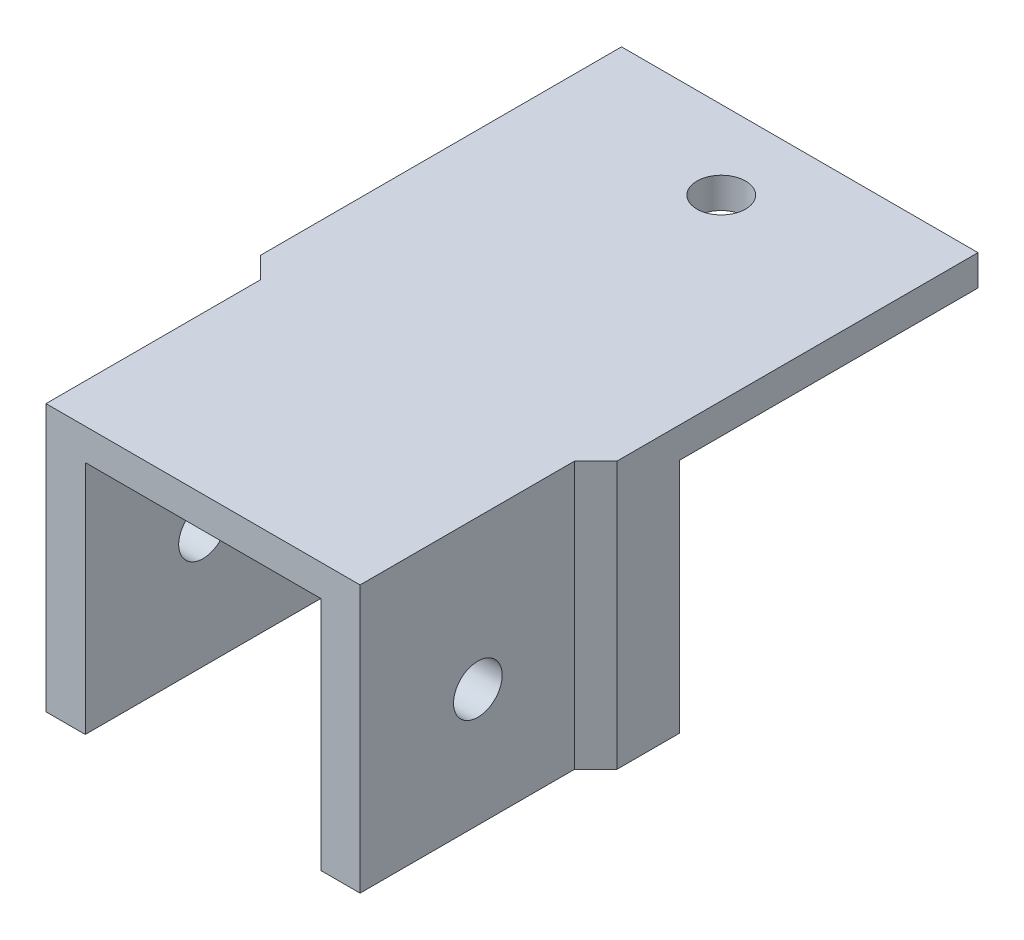
ISO-10303-21;
HEADER;
FILE_DESCRIPTION(('STEP AP214'),'2;1');
FILE_NAME('part.step','',(''),(''),'','','');
FILE_SCHEMA(('AUTOMOTIVE_DESIGN { 1 0 10303 214 1 1 1 1 }'));
ENDSEC;
DATA;
#1=APPLICATION_CONTEXT('core data for automotive mechanical design processes');
#2=APPLICATION_PROTOCOL_DEFINITION('international standard','automotive_design',2000,#1);
#3=PRODUCT_CONTEXT('',#1,'mechanical');
#4=PRODUCT('Part','Part','',(#3));
#5=PRODUCT_RELATED_PRODUCT_CATEGORY('part','',(#4));
#6=PRODUCT_DEFINITION_FORMATION('','',#4);
#7=PRODUCT_DEFINITION_CONTEXT('part definition',#1,'design');
#8=PRODUCT_DEFINITION('design','',#6,#7);
#9=PRODUCT_DEFINITION_SHAPE('','',#8);
#10=(LENGTH_UNIT() NAMED_UNIT(*) SI_UNIT(.MILLI.,.METRE.));
#11=(NAMED_UNIT(*) PLANE_ANGLE_UNIT() SI_UNIT($,.RADIAN.));
#12=(NAMED_UNIT(*) SI_UNIT($,.STERADIAN.) SOLID_ANGLE_UNIT());
#13=UNCERTAINTY_MEASURE_WITH_UNIT(LENGTH_MEASURE(1.E-05),#10,'distance_accuracy_value','');
#14=(GEOMETRIC_REPRESENTATION_CONTEXT(3) GLOBAL_UNCERTAINTY_ASSIGNED_CONTEXT((#13)) GLOBAL_UNIT_ASSIGNED_CONTEXT((#10,
#11,#12)) REPRESENTATION_CONTEXT('',''));
#15=CARTESIAN_POINT('',(0.,0.,0.));
#16=DIRECTION('',(0.,0.,1.));
#17=DIRECTION('',(1.,0.,0.));
#18=AXIS2_PLACEMENT_3D('',#15,#16,#17);
#19=CARTESIAN_POINT('',(22.7,15.,5.));
#20=DIRECTION('',(-1.,0.,0.));
#21=DIRECTION('',(0.,0.,1.));
#22=AXIS2_PLACEMENT_3D('',#19,#20,#21);
#23=PLANE('',#22);
#24=DIRECTION('',(0.,1.,0.));
#25=VECTOR('',#24,1.);
#26=CARTESIAN_POINT('',(22.7,-15.,8.));
#27=LINE('',#26,#25);
#28=CARTESIAN_POINT('',(22.7,-15.,8.));
#29=VERTEX_POINT('',#28);
#30=CARTESIAN_POINT('',(22.7,19.,8.));
#31=VERTEX_POINT('',#30);
#32=EDGE_CURVE('E166',#29,#31,#27,.T.);
#33=ORIENTED_EDGE('',*,*,#32,.F.);
#34=DIRECTION('',(0.,0.,-1.));
#35=VECTOR('',#34,1.);
#36=CARTESIAN_POINT('',(22.7,-15.,5.));
#37=LINE('',#36,#35);
#38=CARTESIAN_POINT('',(22.7,-15.,0.));
#39=VERTEX_POINT('',#38);
#40=EDGE_CURVE('E154',#29,#39,#37,.T.);
#41=ORIENTED_EDGE('',*,*,#40,.T.);
#42=DIRECTION('',(0.,1.,0.));
#43=VECTOR('',#42,1.);
#44=CARTESIAN_POINT('',(22.7,15.,0.));
#45=LINE('',#44,#43);
#46=CARTESIAN_POINT('',(22.7,15.1,0.));
#47=VERTEX_POINT('',#46);
#48=EDGE_CURVE('E289',#39,#47,#45,.T.);
#49=ORIENTED_EDGE('',*,*,#48,.T.);
#50=DIRECTION('',(0.,0.,-1.));
#51=VECTOR('',#50,1.);
#52=CARTESIAN_POINT('',(22.7,15.1,-38.));
#53=LINE('',#52,#51);
#54=CARTESIAN_POINT('',(22.7,15.1,-38.));
#55=VERTEX_POINT('',#54);
#56=EDGE_CURVE('E186',#47,#55,#53,.T.);
#57=ORIENTED_EDGE('',*,*,#56,.T.);
#58=DIRECTION('',(0.,1.,0.));
#59=VECTOR('',#58,1.);
#60=CARTESIAN_POINT('',(22.7,15.1,-38.));
#61=LINE('',#60,#59);
#62=CARTESIAN_POINT('',(22.7,19.,-38.));
#63=VERTEX_POINT('',#62);
#64=EDGE_CURVE('E194',#55,#63,#61,.T.);
#65=ORIENTED_EDGE('',*,*,#64,.T.);
#66=DIRECTION('',(0.,0.,-1.));
#67=VECTOR('',#66,1.);
#68=CARTESIAN_POINT('',(22.7,19.,5.));
#69=LINE('',#68,#67);
#70=EDGE_CURVE('E299',#31,#63,#69,.T.);
#71=ORIENTED_EDGE('',*,*,#70,.F.);
#72=EDGE_LOOP('',(#33,#41,#49,#57,#65,#71));
#73=FACE_BOUND('',#72,.T.);
#74=ADVANCED_FACE('F37',(#73),#23,.F.);
#75=CARTESIAN_POINT('',(-22.7,-15.,5.));
#76=DIRECTION('',(1.,0.,0.));
#77=DIRECTION('',(0.,0.,-1.));
#78=AXIS2_PLACEMENT_3D('',#75,#76,#77);
#79=PLANE('',#78);
#80=DIRECTION('',(0.,-1.,0.));
#81=VECTOR('',#80,1.);
#82=CARTESIAN_POINT('',(-22.7,19.,8.));
#83=LINE('',#82,#81);
#84=CARTESIAN_POINT('',(-22.7,19.,8.));
#85=VERTEX_POINT('',#84);
#86=CARTESIAN_POINT('',(-22.7,-15.,8.));
#87=VERTEX_POINT('',#86);
#88=EDGE_CURVE('E148',#85,#87,#83,.T.);
#89=ORIENTED_EDGE('',*,*,#88,.F.);
#90=DIRECTION('',(0.,0.,-1.));
#91=VECTOR('',#90,1.);
#92=CARTESIAN_POINT('',(-22.7,19.,5.));
#93=LINE('',#92,#91);
#94=CARTESIAN_POINT('',(-22.7,19.,-38.));
#95=VERTEX_POINT('',#94);
#96=EDGE_CURVE('E153',#85,#95,#93,.T.);
#97=ORIENTED_EDGE('',*,*,#96,.T.);
#98=DIRECTION('',(0.,1.,0.));
#99=VECTOR('',#98,1.);
#100=CARTESIAN_POINT('',(-22.7,15.1,-38.));
#101=LINE('',#100,#99);
#102=CARTESIAN_POINT('',(-22.7,15.1,-38.));
#103=VERTEX_POINT('',#102);
#104=EDGE_CURVE('E197',#103,#95,#101,.T.);
#105=ORIENTED_EDGE('',*,*,#104,.F.);
#106=DIRECTION('',(0.,0.,1.));
#107=VECTOR('',#106,1.);
#108=CARTESIAN_POINT('',(-22.7,15.1,0.));
#109=LINE('',#108,#107);
#110=CARTESIAN_POINT('',(-22.7,15.1,0.));
#111=VERTEX_POINT('',#110);
#112=EDGE_CURVE('E192',#103,#111,#109,.T.);
#113=ORIENTED_EDGE('',*,*,#112,.T.);
#114=DIRECTION('',(0.,-1.,0.));
#115=VECTOR('',#114,1.);
#116=CARTESIAN_POINT('',(-22.7,-15.,0.));
#117=LINE('',#116,#115);
#118=CARTESIAN_POINT('',(-22.7,-15.,0.));
#119=VERTEX_POINT('',#118);
#120=EDGE_CURVE('E151',#111,#119,#117,.T.);
#121=ORIENTED_EDGE('',*,*,#120,.T.);
#122=DIRECTION('',(0.,0.,-1.));
#123=VECTOR('',#122,1.);
#124=CARTESIAN_POINT('',(-22.7,-15.,5.));
#125=LINE('',#124,#123);
#126=EDGE_CURVE('E140',#87,#119,#125,.T.);
#127=ORIENTED_EDGE('',*,*,#126,.F.);
#128=EDGE_LOOP('',(#89,#97,#105,#113,#121,#127));
#129=FACE_BOUND('',#128,.T.);
#130=ADVANCED_FACE('F147',(#129),#79,.F.);
#131=CARTESIAN_POINT('',(0.,0.,8.));
#132=DIRECTION('',(0.,0.,1.));
#133=DIRECTION('',(1.,0.,0.));
#134=AXIS2_PLACEMENT_3D('',#131,#132,#133);
#135=PLANE('',#134);
#136=CARTESIAN_POINT('',(-10.,10.,8.));
#137=DIRECTION('',(0.,0.,1.));
#138=DIRECTION('',(1.,0.,0.));
#139=AXIS2_PLACEMENT_3D('',#136,#137,#138);
#140=CIRCLE('',#139,3.);
#141=CARTESIAN_POINT('',(-7.,10.,8.));
#142=VERTEX_POINT('',#141);
#143=EDGE_CURVE('E248',#142,#142,#140,.T.);
#144=ORIENTED_EDGE('',*,*,#143,.F.);
#145=EDGE_LOOP('',(#144));
#146=FACE_BOUND('',#145,.T.);
#147=CARTESIAN_POINT('',(10.,-10.,8.));
#148=DIRECTION('',(0.,0.,1.));
#149=DIRECTION('',(1.,0.,0.));
#150=AXIS2_PLACEMENT_3D('',#147,#148,#149);
#151=CIRCLE('',#150,3.);
#152=CARTESIAN_POINT('',(13.,-10.,8.));
#153=VERTEX_POINT('',#152);
#154=EDGE_CURVE('E260',#153,#153,#151,.T.);
#155=ORIENTED_EDGE('',*,*,#154,.F.);
#156=EDGE_LOOP('',(#155));
#157=FACE_BOUND('',#156,.T.);
#158=CARTESIAN_POINT('',(10.,10.,8.));
#159=DIRECTION('',(0.,0.,1.));
#160=DIRECTION('',(1.,0.,0.));
#161=AXIS2_PLACEMENT_3D('',#158,#159,#160);
#162=CIRCLE('',#161,3.);
#163=CARTESIAN_POINT('',(13.,10.,8.));
#164=VERTEX_POINT('',#163);
#165=EDGE_CURVE('E254',#164,#164,#162,.T.);
#166=ORIENTED_EDGE('',*,*,#165,.F.);
#167=EDGE_LOOP('',(#166));
#168=FACE_BOUND('',#167,.T.);
#169=CARTESIAN_POINT('',(-10.,-10.,8.));
#170=DIRECTION('',(0.,0.,1.));
#171=DIRECTION('',(1.,0.,0.));
#172=AXIS2_PLACEMENT_3D('',#169,#170,#171);
#173=CIRCLE('',#172,3.);
#174=CARTESIAN_POINT('',(-7.,-10.,8.));
#175=VERTEX_POINT('',#174);
#176=EDGE_CURVE('E242',#175,#175,#173,.T.);
#177=ORIENTED_EDGE('',*,*,#176,.F.);
#178=EDGE_LOOP('',(#177));
#179=FACE_BOUND('',#178,.T.);
#180=DIRECTION('',(1.,0.,0.));
#181=VECTOR('',#180,1.);
#182=CARTESIAN_POINT('',(0.,15.,8.));
#183=LINE('',#182,#181);
#184=CARTESIAN_POINT('',(-15.,15.,8.));
#185=VERTEX_POINT('',#184);
#186=CARTESIAN_POINT('',(15.,15.,8.));
#187=VERTEX_POINT('',#186);
#188=EDGE_CURVE('E206',#185,#187,#183,.T.);
#189=ORIENTED_EDGE('',*,*,#188,.F.);
#190=DIRECTION('',(0.,-1.,0.));
#191=VECTOR('',#190,1.);
#192=CARTESIAN_POINT('',(-15.,0.,8.));
#193=LINE('',#192,#191);
#194=CARTESIAN_POINT('',(-15.,-15.,8.));
#195=VERTEX_POINT('',#194);
#196=EDGE_CURVE('E211',#185,#195,#193,.T.);
#197=ORIENTED_EDGE('',*,*,#196,.T.);
#198=DIRECTION('',(1.,0.,0.));
#199=VECTOR('',#198,1.);
#200=CARTESIAN_POINT('',(-22.7,-15.,8.));
#201=LINE('',#200,#199);
#202=CARTESIAN_POINT('',(15.,-15.,8.));
#203=VERTEX_POINT('',#202);
#204=EDGE_CURVE('E263',#195,#203,#201,.T.);
#205=ORIENTED_EDGE('',*,*,#204,.T.);
#206=DIRECTION('',(0.,-1.,0.));
#207=VECTOR('',#206,1.);
#208=CARTESIAN_POINT('',(15.,0.,8.));
#209=LINE('',#208,#207);
#210=EDGE_CURVE('E226',#187,#203,#209,.T.);
#211=ORIENTED_EDGE('',*,*,#210,.F.);
#212=EDGE_LOOP('',(#189,#197,#205,#211));
#213=FACE_BOUND('',#212,.T.);
#214=ADVANCED_FACE('F342',(#146,#157,#168,#179,#213),#135,.T.);
#215=CARTESIAN_POINT('',(0.,0.,5.));
#216=DIRECTION('',(0.,0.,1.));
#217=DIRECTION('',(1.,0.,0.));
#218=AXIS2_PLACEMENT_3D('',#215,#216,#217);
#219=PLANE('',#218);
#220=CARTESIAN_POINT('',(10.,-10.,5.));
#221=DIRECTION('',(0.,0.,1.));
#222=DIRECTION('',(1.,0.,0.));
#223=AXIS2_PLACEMENT_3D('',#220,#221,#222);
#224=CIRCLE('',#223,1.6);
#225=CARTESIAN_POINT('',(11.6,-10.,5.));
#226=VERTEX_POINT('',#225);
#227=EDGE_CURVE('E274',#226,#226,#224,.T.);
#228=ORIENTED_EDGE('',*,*,#227,.F.);
#229=EDGE_LOOP('',(#228));
#230=FACE_BOUND('',#229,.T.);
#231=CARTESIAN_POINT('',(10.,-10.,5.));
#232=DIRECTION('',(0.,0.,1.));
#233=DIRECTION('',(1.,0.,0.));
#234=AXIS2_PLACEMENT_3D('',#231,#232,#233);
#235=CIRCLE('',#234,3.);
#236=CARTESIAN_POINT('',(13.,-10.,5.));
#237=VERTEX_POINT('',#236);
#238=EDGE_CURVE('E257',#237,#237,#235,.T.);
#239=ORIENTED_EDGE('',*,*,#238,.T.);
#240=EDGE_LOOP('',(#239));
#241=FACE_BOUND('',#240,.T.);
#242=ADVANCED_FACE('F533',(#230,#241),#219,.T.);
#243=CARTESIAN_POINT('',(10.,10.,5.));
#244=DIRECTION('',(0.,0.,1.));
#245=DIRECTION('',(1.,0.,0.));
#246=AXIS2_PLACEMENT_3D('',#243,#244,#245);
#247=CIRCLE('',#246,1.6);
#248=CARTESIAN_POINT('',(11.6,10.,5.));
#249=VERTEX_POINT('',#248);
#250=EDGE_CURVE('E280',#249,#249,#247,.T.);
#251=ORIENTED_EDGE('',*,*,#250,.F.);
#252=EDGE_LOOP('',(#251));
#253=FACE_BOUND('',#252,.T.);
#254=CARTESIAN_POINT('',(10.,10.,5.));
#255=DIRECTION('',(0.,0.,1.));
#256=DIRECTION('',(1.,0.,0.));
#257=AXIS2_PLACEMENT_3D('',#254,#255,#256);
#258=CIRCLE('',#257,3.);
#259=CARTESIAN_POINT('',(13.,10.,5.));
#260=VERTEX_POINT('',#259);
#261=EDGE_CURVE('E251',#260,#260,#258,.T.);
#262=ORIENTED_EDGE('',*,*,#261,.T.);
#263=EDGE_LOOP('',(#262));
#264=FACE_BOUND('',#263,.T.);
#265=ADVANCED_FACE('F596',(#253,#264),#219,.T.);
#266=CARTESIAN_POINT('',(-10.,10.,5.));
#267=DIRECTION('',(0.,0.,1.));
#268=DIRECTION('',(1.,0.,0.));
#269=AXIS2_PLACEMENT_3D('',#266,#267,#268);
#270=CIRCLE('',#269,1.6);
#271=CARTESIAN_POINT('',(-8.4,10.,5.));
#272=VERTEX_POINT('',#271);
#273=EDGE_CURVE('E286',#272,#272,#270,.T.);
#274=ORIENTED_EDGE('',*,*,#273,.F.);
#275=EDGE_LOOP('',(#274));
#276=FACE_BOUND('',#275,.T.);
#277=CARTESIAN_POINT('',(-10.,10.,5.));
#278=DIRECTION('',(0.,0.,1.));
#279=DIRECTION('',(1.,0.,0.));
#280=AXIS2_PLACEMENT_3D('',#277,#278,#279);
#281=CIRCLE('',#280,3.);
#282=CARTESIAN_POINT('',(-7.,10.,5.));
#283=VERTEX_POINT('',#282);
#284=EDGE_CURVE('E245',#283,#283,#281,.T.);
#285=ORIENTED_EDGE('',*,*,#284,.T.);
#286=EDGE_LOOP('',(#285));
#287=FACE_BOUND('',#286,.T.);
#288=ADVANCED_FACE('F585',(#276,#287),#219,.T.);
#289=CARTESIAN_POINT('',(-10.,-10.,5.));
#290=DIRECTION('',(0.,0.,1.));
#291=DIRECTION('',(1.,0.,0.));
#292=AXIS2_PLACEMENT_3D('',#289,#290,#291);
#293=CIRCLE('',#292,1.6);
#294=CARTESIAN_POINT('',(-8.4,-10.,5.));
#295=VERTEX_POINT('',#294);
#296=EDGE_CURVE('E268',#295,#295,#293,.T.);
#297=ORIENTED_EDGE('',*,*,#296,.F.);
#298=EDGE_LOOP('',(#297));
#299=FACE_BOUND('',#298,.T.);
#300=CARTESIAN_POINT('',(-10.,-10.,5.));
#301=DIRECTION('',(0.,0.,1.));
#302=DIRECTION('',(1.,0.,0.));
#303=AXIS2_PLACEMENT_3D('',#300,#301,#302);
#304=CIRCLE('',#303,3.);
#305=CARTESIAN_POINT('',(-7.,-10.,5.));
#306=VERTEX_POINT('',#305);
#307=EDGE_CURVE('E241',#306,#306,#304,.T.);
#308=ORIENTED_EDGE('',*,*,#307,.T.);
#309=EDGE_LOOP('',(#308));
#310=FACE_BOUND('',#309,.T.);
#311=ADVANCED_FACE('F500',(#299,#310),#219,.T.);
#312=CARTESIAN_POINT('',(0.,0.,0.));
#313=DIRECTION('',(0.,0.,1.));
#314=DIRECTION('',(1.,0.,0.));
#315=AXIS2_PLACEMENT_3D('',#312,#313,#314);
#316=PLANE('',#315);
#317=ORIENTED_EDGE('',*,*,#120,.F.);
#318=DIRECTION('',(1.,0.,0.));
#319=VECTOR('',#318,1.);
#320=CARTESIAN_POINT('',(22.7,15.1,0.));
#321=LINE('',#320,#319);
#322=EDGE_CURVE('E183',#111,#47,#321,.T.);
#323=ORIENTED_EDGE('',*,*,#322,.T.);
#324=ORIENTED_EDGE('',*,*,#48,.F.);
#325=DIRECTION('',(1.,0.,0.));
#326=VECTOR('',#325,1.);
#327=CARTESIAN_POINT('',(-22.7,-15.,0.));
#328=LINE('',#327,#326);
#329=EDGE_CURVE('E295',#119,#39,#328,.T.);
#330=ORIENTED_EDGE('',*,*,#329,.F.);
#331=EDGE_LOOP('',(#317,#323,#324,#330));
#332=FACE_BOUND('',#331,.T.);
#333=CARTESIAN_POINT('',(-10.,10.,0.));
#334=DIRECTION('',(0.,0.,1.));
#335=DIRECTION('',(1.,0.,0.));
#336=AXIS2_PLACEMENT_3D('',#333,#334,#335);
#337=CIRCLE('',#336,1.6);
#338=CARTESIAN_POINT('',(-8.4,10.,0.));
#339=VERTEX_POINT('',#338);
#340=EDGE_CURVE('E283',#339,#339,#337,.T.);
#341=ORIENTED_EDGE('',*,*,#340,.T.);
#342=EDGE_LOOP('',(#341));
#343=FACE_BOUND('',#342,.T.);
#344=CARTESIAN_POINT('',(10.,10.,0.));
#345=DIRECTION('',(0.,0.,1.));
#346=DIRECTION('',(1.,0.,0.));
#347=AXIS2_PLACEMENT_3D('',#344,#345,#346);
#348=CIRCLE('',#347,1.6);
#349=CARTESIAN_POINT('',(11.6,10.,0.));
#350=VERTEX_POINT('',#349);
#351=EDGE_CURVE('E277',#350,#350,#348,.T.);
#352=ORIENTED_EDGE('',*,*,#351,.T.);
#353=EDGE_LOOP('',(#352));
#354=FACE_BOUND('',#353,.T.);
#355=CARTESIAN_POINT('',(10.,-10.,0.));
#356=DIRECTION('',(0.,0.,1.));
#357=DIRECTION('',(1.,0.,0.));
#358=AXIS2_PLACEMENT_3D('',#355,#356,#357);
#359=CIRCLE('',#358,1.6);
#360=CARTESIAN_POINT('',(11.6,-10.,0.));
#361=VERTEX_POINT('',#360);
#362=EDGE_CURVE('E271',#361,#361,#359,.T.);
#363=ORIENTED_EDGE('',*,*,#362,.T.);
#364=EDGE_LOOP('',(#363));
#365=FACE_BOUND('',#364,.T.);
#366=CARTESIAN_POINT('',(-10.,-10.,0.));
#367=DIRECTION('',(0.,0.,1.));
#368=DIRECTION('',(1.,0.,0.));
#369=AXIS2_PLACEMENT_3D('',#366,#367,#368);
#370=CIRCLE('',#369,1.6);
#371=CARTESIAN_POINT('',(-8.4,-10.,0.));
#372=VERTEX_POINT('',#371);
#373=EDGE_CURVE('E267',#372,#372,#370,.T.);
#374=ORIENTED_EDGE('',*,*,#373,.T.);
#375=EDGE_LOOP('',(#374));
#376=FACE_BOUND('',#375,.T.);
#377=ADVANCED_FACE('F429',(#332,#343,#354,#365,#376),#316,.F.);
#378=CARTESIAN_POINT('',(22.7,19.,5.));
#379=DIRECTION('',(0.,-1.,0.));
#380=DIRECTION('',(0.,0.,-1.));
#381=AXIS2_PLACEMENT_3D('',#378,#379,#380);
#382=PLANE('',#381);
#383=ORIENTED_EDGE('',*,*,#96,.F.);
#384=DIRECTION('',(0.707106781186551,0.,0.707106781186544));
#385=VECTOR('',#384,1.);
#386=CARTESIAN_POINT('',(-1.49999999999979,19.,29.2));
#387=LINE('',#386,#385);
#388=CARTESIAN_POINT('',(-20.,19.,10.7));
#389=VERTEX_POINT('',#388);
#390=EDGE_CURVE('E46',#85,#389,#387,.T.);
#391=ORIENTED_EDGE('',*,*,#390,.T.);
#392=DIRECTION('',(0.,0.,1.));
#393=VECTOR('',#392,1.);
#394=CARTESIAN_POINT('',(-20.,19.,8.));
#395=LINE('',#394,#393);
#396=CARTESIAN_POINT('',(-20.,19.,38.));
#397=VERTEX_POINT('',#396);
#398=EDGE_CURVE('E158',#389,#397,#395,.T.);
#399=ORIENTED_EDGE('',*,*,#398,.T.);
#400=DIRECTION('',(-1.,0.,0.));
#401=VECTOR('',#400,1.);
#402=CARTESIAN_POINT('',(0.,19.,38.));
#403=LINE('',#402,#401);
#404=CARTESIAN_POINT('',(20.,19.,38.));
#405=VERTEX_POINT('',#404);
#406=EDGE_CURVE('E216',#405,#397,#403,.T.);
#407=ORIENTED_EDGE('',*,*,#406,.F.);
#408=DIRECTION('',(0.,0.,1.));
#409=VECTOR('',#408,1.);
#410=CARTESIAN_POINT('',(20.,19.,8.));
#411=LINE('',#410,#409);
#412=CARTESIAN_POINT('',(20.,19.,10.7));
#413=VERTEX_POINT('',#412);
#414=EDGE_CURVE('E169',#413,#405,#411,.T.);
#415=ORIENTED_EDGE('',*,*,#414,.F.);
#416=DIRECTION('',(0.707106781186551,0.,-0.707106781186544));
#417=VECTOR('',#416,1.);
#418=CARTESIAN_POINT('',(24.2,19.,6.50000000000003));
#419=LINE('',#418,#417);
#420=EDGE_CURVE('E312',#413,#31,#419,.T.);
#421=ORIENTED_EDGE('',*,*,#420,.T.);
#422=ORIENTED_EDGE('',*,*,#70,.T.);
#423=DIRECTION('',(-1.,0.,0.));
#424=VECTOR('',#423,1.);
#425=CARTESIAN_POINT('',(-22.7,19.,-38.));
#426=LINE('',#425,#424);
#427=EDGE_CURVE('E178',#63,#95,#426,.T.);
#428=ORIENTED_EDGE('',*,*,#427,.T.);
#429=EDGE_LOOP('',(#383,#391,#399,#407,#415,#421,#422,#428));
#430=FACE_BOUND('',#429,.T.);
#431=CARTESIAN_POINT('',(0.,19.,-28.));
#432=DIRECTION('',(0.,1.,0.));
#433=DIRECTION('',(0.,0.,1.));
#434=AXIS2_PLACEMENT_3D('',#431,#432,#433);
#435=CIRCLE('',#434,3.1);
#436=CARTESIAN_POINT('',(0.,19.,-24.9));
#437=VERTEX_POINT('',#436);
#438=EDGE_CURVE('E179',#437,#437,#435,.T.);
#439=ORIENTED_EDGE('',*,*,#438,.F.);
#440=EDGE_LOOP('',(#439));
#441=FACE_BOUND('',#440,.T.);
#442=ADVANCED_FACE('F316',(#430,#441),#382,.F.);
#443=CARTESIAN_POINT('',(-22.7,-15.,5.));
#444=DIRECTION('',(0.,1.,0.));
#445=DIRECTION('',(0.,0.,1.));
#446=AXIS2_PLACEMENT_3D('',#443,#444,#445);
#447=PLANE('',#446);
#448=DIRECTION('',(1.,0.,0.));
#449=VECTOR('',#448,1.);
#450=CARTESIAN_POINT('',(0.,-15.,38.));
#451=LINE('',#450,#449);
#452=CARTESIAN_POINT('',(-20.,-15.,38.));
#453=VERTEX_POINT('',#452);
#454=CARTESIAN_POINT('',(-15.,-15.,38.));
#455=VERTEX_POINT('',#454);
#456=EDGE_CURVE('E217',#453,#455,#451,.T.);
#457=ORIENTED_EDGE('',*,*,#456,.F.);
#458=DIRECTION('',(0.,0.,1.));
#459=VECTOR('',#458,1.);
#460=CARTESIAN_POINT('',(-20.,-15.,8.));
#461=LINE('',#460,#459);
#462=CARTESIAN_POINT('',(-20.,-15.,10.7));
#463=VERTEX_POINT('',#462);
#464=EDGE_CURVE('E142',#463,#453,#461,.T.);
#465=ORIENTED_EDGE('',*,*,#464,.F.);
#466=DIRECTION('',(-0.707106781186551,0.,-0.707106781186544));
#467=VECTOR('',#466,1.);
#468=CARTESIAN_POINT('',(-24.2,-15.,6.50000000000002));
#469=LINE('',#468,#467);
#470=EDGE_CURVE('E11',#463,#87,#469,.T.);
#471=ORIENTED_EDGE('',*,*,#470,.T.);
#472=ORIENTED_EDGE('',*,*,#126,.T.);
#473=ORIENTED_EDGE('',*,*,#329,.T.);
#474=ORIENTED_EDGE('',*,*,#40,.F.);
#475=DIRECTION('',(-0.707106781186551,0.,0.707106781186544));
#476=VECTOR('',#475,1.);
#477=CARTESIAN_POINT('',(1.49999999999978,-15.,29.2));
#478=LINE('',#477,#476);
#479=CARTESIAN_POINT('',(20.,-15.,10.7));
#480=VERTEX_POINT('',#479);
#481=EDGE_CURVE('E310',#29,#480,#478,.T.);
#482=ORIENTED_EDGE('',*,*,#481,.T.);
#483=DIRECTION('',(0.,0.,1.));
#484=VECTOR('',#483,1.);
#485=CARTESIAN_POINT('',(20.,-15.,8.));
#486=LINE('',#485,#484);
#487=CARTESIAN_POINT('',(20.,-15.,38.));
#488=VERTEX_POINT('',#487);
#489=EDGE_CURVE('E161',#480,#488,#486,.T.);
#490=ORIENTED_EDGE('',*,*,#489,.T.);
#491=CARTESIAN_POINT('',(15.,-15.,38.));
#492=VERTEX_POINT('',#491);
#493=EDGE_CURVE('E213',#492,#488,#451,.T.);
#494=ORIENTED_EDGE('',*,*,#493,.F.);
#495=DIRECTION('',(0.,0.,-1.));
#496=VECTOR('',#495,1.);
#497=CARTESIAN_POINT('',(15.,-15.,38.));
#498=LINE('',#497,#496);
#499=EDGE_CURVE('E235',#492,#203,#498,.T.);
#500=ORIENTED_EDGE('',*,*,#499,.T.);
#501=ORIENTED_EDGE('',*,*,#204,.F.);
#502=DIRECTION('',(0.,0.,-1.));
#503=VECTOR('',#502,1.);
#504=CARTESIAN_POINT('',(-15.,-15.,38.));
#505=LINE('',#504,#503);
#506=EDGE_CURVE('E232',#455,#195,#505,.T.);
#507=ORIENTED_EDGE('',*,*,#506,.F.);
#508=EDGE_LOOP('',(#457,#465,#471,#472,#473,#474,#482,#490,#494,#500,#501,#507));
#509=FACE_BOUND('',#508,.T.);
#510=ADVANCED_FACE('F138',(#509),#447,.F.);
#511=CARTESIAN_POINT('',(-10.,10.,5.));
#512=DIRECTION('',(0.,0.,-1.));
#513=DIRECTION('',(-1.,0.,0.));
#514=AXIS2_PLACEMENT_3D('',#511,#512,#513);
#515=CYLINDRICAL_SURFACE('',#514,1.6);
#516=ORIENTED_EDGE('',*,*,#273,.T.);
#517=EDGE_LOOP('',(#516));
#518=FACE_BOUND('',#517,.T.);
#519=ORIENTED_EDGE('',*,*,#340,.F.);
#520=EDGE_LOOP('',(#519));
#521=FACE_BOUND('',#520,.T.);
#522=ADVANCED_FACE('F417',(#518,#521),#515,.F.);
#523=CARTESIAN_POINT('',(10.,10.,5.));
#524=DIRECTION('',(0.,0.,-1.));
#525=DIRECTION('',(-1.,0.,0.));
#526=AXIS2_PLACEMENT_3D('',#523,#524,#525);
#527=CYLINDRICAL_SURFACE('',#526,1.6);
#528=ORIENTED_EDGE('',*,*,#250,.T.);
#529=EDGE_LOOP('',(#528));
#530=FACE_BOUND('',#529,.T.);
#531=ORIENTED_EDGE('',*,*,#351,.F.);
#532=EDGE_LOOP('',(#531));
#533=FACE_BOUND('',#532,.T.);
#534=ADVANCED_FACE('F629',(#530,#533),#527,.F.);
#535=CARTESIAN_POINT('',(10.,-10.,5.));
#536=DIRECTION('',(0.,0.,-1.));
#537=DIRECTION('',(-1.,0.,0.));
#538=AXIS2_PLACEMENT_3D('',#535,#536,#537);
#539=CYLINDRICAL_SURFACE('',#538,1.6);
#540=ORIENTED_EDGE('',*,*,#227,.T.);
#541=EDGE_LOOP('',(#540));
#542=FACE_BOUND('',#541,.T.);
#543=ORIENTED_EDGE('',*,*,#362,.F.);
#544=EDGE_LOOP('',(#543));
#545=FACE_BOUND('',#544,.T.);
#546=ADVANCED_FACE('F619',(#542,#545),#539,.F.);
#547=CARTESIAN_POINT('',(-10.,-10.,5.));
#548=DIRECTION('',(0.,0.,-1.));
#549=DIRECTION('',(-1.,0.,0.));
#550=AXIS2_PLACEMENT_3D('',#547,#548,#549);
#551=CYLINDRICAL_SURFACE('',#550,1.6);
#552=ORIENTED_EDGE('',*,*,#296,.T.);
#553=EDGE_LOOP('',(#552));
#554=FACE_BOUND('',#553,.T.);
#555=ORIENTED_EDGE('',*,*,#373,.F.);
#556=EDGE_LOOP('',(#555));
#557=FACE_BOUND('',#556,.T.);
#558=ADVANCED_FACE('F574',(#554,#557),#551,.F.);
#559=CARTESIAN_POINT('',(10.,-10.,8.));
#560=DIRECTION('',(0.,0.,-1.));
#561=DIRECTION('',(-1.,0.,0.));
#562=AXIS2_PLACEMENT_3D('',#559,#560,#561);
#563=CYLINDRICAL_SURFACE('',#562,3.);
#564=ORIENTED_EDGE('',*,*,#154,.T.);
#565=EDGE_LOOP('',(#564));
#566=FACE_BOUND('',#565,.T.);
#567=ORIENTED_EDGE('',*,*,#238,.F.);
#568=EDGE_LOOP('',(#567));
#569=FACE_BOUND('',#568,.T.);
#570=ADVANCED_FACE('F564',(#566,#569),#563,.F.);
#571=CARTESIAN_POINT('',(10.,10.,8.));
#572=DIRECTION('',(0.,0.,-1.));
#573=DIRECTION('',(-1.,0.,0.));
#574=AXIS2_PLACEMENT_3D('',#571,#572,#573);
#575=CYLINDRICAL_SURFACE('',#574,3.);
#576=ORIENTED_EDGE('',*,*,#165,.T.);
#577=EDGE_LOOP('',(#576));
#578=FACE_BOUND('',#577,.T.);
#579=ORIENTED_EDGE('',*,*,#261,.F.);
#580=EDGE_LOOP('',(#579));
#581=FACE_BOUND('',#580,.T.);
#582=ADVANCED_FACE('F554',(#578,#581),#575,.F.);
#583=CARTESIAN_POINT('',(-10.,10.,8.));
#584=DIRECTION('',(0.,0.,-1.));
#585=DIRECTION('',(-1.,0.,0.));
#586=AXIS2_PLACEMENT_3D('',#583,#584,#585);
#587=CYLINDRICAL_SURFACE('',#586,3.);
#588=ORIENTED_EDGE('',*,*,#143,.T.);
#589=EDGE_LOOP('',(#588));
#590=FACE_BOUND('',#589,.T.);
#591=ORIENTED_EDGE('',*,*,#284,.F.);
#592=EDGE_LOOP('',(#591));
#593=FACE_BOUND('',#592,.T.);
#594=ADVANCED_FACE('F544',(#590,#593),#587,.F.);
#595=CARTESIAN_POINT('',(-10.,-10.,8.));
#596=DIRECTION('',(0.,0.,-1.));
#597=DIRECTION('',(-1.,0.,0.));
#598=AXIS2_PLACEMENT_3D('',#595,#596,#597);
#599=CYLINDRICAL_SURFACE('',#598,3.);
#600=ORIENTED_EDGE('',*,*,#176,.T.);
#601=EDGE_LOOP('',(#600));
#602=FACE_BOUND('',#601,.T.);
#603=ORIENTED_EDGE('',*,*,#307,.F.);
#604=EDGE_LOOP('',(#603));
#605=FACE_BOUND('',#604,.T.);
#606=ADVANCED_FACE('F523',(#602,#605),#599,.F.);
#607=CARTESIAN_POINT('',(0.,15.,38.));
#608=DIRECTION('',(0.,1.,0.));
#609=DIRECTION('',(0.,0.,1.));
#610=AXIS2_PLACEMENT_3D('',#607,#608,#609);
#611=PLANE('',#610);
#612=ORIENTED_EDGE('',*,*,#188,.T.);
#613=DIRECTION('',(0.,0.,-1.));
#614=VECTOR('',#613,1.);
#615=CARTESIAN_POINT('',(15.,15.,38.));
#616=LINE('',#615,#614);
#617=CARTESIAN_POINT('',(15.,15.,38.));
#618=VERTEX_POINT('',#617);
#619=EDGE_CURVE('E238',#618,#187,#616,.T.);
#620=ORIENTED_EDGE('',*,*,#619,.F.);
#621=DIRECTION('',(1.,0.,0.));
#622=VECTOR('',#621,1.);
#623=CARTESIAN_POINT('',(0.,15.,38.));
#624=LINE('',#623,#622);
#625=CARTESIAN_POINT('',(-15.,15.,38.));
#626=VERTEX_POINT('',#625);
#627=EDGE_CURVE('E207',#626,#618,#624,.T.);
#628=ORIENTED_EDGE('',*,*,#627,.F.);
#629=DIRECTION('',(0.,0.,-1.));
#630=VECTOR('',#629,1.);
#631=CARTESIAN_POINT('',(-15.,15.,38.));
#632=LINE('',#631,#630);
#633=EDGE_CURVE('E223',#626,#185,#632,.T.);
#634=ORIENTED_EDGE('',*,*,#633,.T.);
#635=EDGE_LOOP('',(#612,#620,#628,#634));
#636=FACE_BOUND('',#635,.T.);
#637=ADVANCED_FACE('F368',(#636),#611,.F.);
#638=CARTESIAN_POINT('',(15.,0.,38.));
#639=DIRECTION('',(1.,0.,0.));
#640=DIRECTION('',(0.,0.,-1.));
#641=AXIS2_PLACEMENT_3D('',#638,#639,#640);
#642=PLANE('',#641);
#643=CARTESIAN_POINT('',(15.,0.,23.));
#644=DIRECTION('',(1.,0.,0.));
#645=DIRECTION('',(0.,0.,-1.));
#646=AXIS2_PLACEMENT_3D('',#643,#644,#645);
#647=CIRCLE('',#646,3.1);
#648=CARTESIAN_POINT('',(15.,0.,19.9));
#649=VERTEX_POINT('',#648);
#650=EDGE_CURVE('E203',#649,#649,#647,.T.);
#651=ORIENTED_EDGE('',*,*,#650,.T.);
#652=EDGE_LOOP('',(#651));
#653=FACE_BOUND('',#652,.T.);
#654=ORIENTED_EDGE('',*,*,#210,.T.);
#655=ORIENTED_EDGE('',*,*,#499,.F.);
#656=DIRECTION('',(0.,-1.,0.));
#657=VECTOR('',#656,1.);
#658=CARTESIAN_POINT('',(15.,0.,38.));
#659=LINE('',#658,#657);
#660=EDGE_CURVE('E210',#618,#492,#659,.T.);
#661=ORIENTED_EDGE('',*,*,#660,.F.);
#662=ORIENTED_EDGE('',*,*,#619,.T.);
#663=EDGE_LOOP('',(#654,#655,#661,#662));
#664=FACE_BOUND('',#663,.T.);
#665=ADVANCED_FACE('F339',(#653,#664),#642,.F.);
#666=CARTESIAN_POINT('',(-15.,0.,38.));
#667=DIRECTION('',(1.,0.,0.));
#668=DIRECTION('',(0.,0.,-1.));
#669=AXIS2_PLACEMENT_3D('',#666,#667,#668);
#670=PLANE('',#669);
#671=CARTESIAN_POINT('',(-15.,0.,23.));
#672=DIRECTION('',(1.,0.,0.));
#673=DIRECTION('',(0.,0.,-1.));
#674=AXIS2_PLACEMENT_3D('',#671,#672,#673);
#675=CIRCLE('',#674,3.1);
#676=CARTESIAN_POINT('',(-15.,0.,19.9));
#677=VERTEX_POINT('',#676);
#678=EDGE_CURVE('E200',#677,#677,#675,.T.);
#679=ORIENTED_EDGE('',*,*,#678,.F.);
#680=EDGE_LOOP('',(#679));
#681=FACE_BOUND('',#680,.T.);
#682=ORIENTED_EDGE('',*,*,#196,.F.);
#683=ORIENTED_EDGE('',*,*,#633,.F.);
#684=DIRECTION('',(0.,-1.,0.));
#685=VECTOR('',#684,1.);
#686=CARTESIAN_POINT('',(-15.,0.,38.));
#687=LINE('',#686,#685);
#688=EDGE_CURVE('E220',#626,#455,#687,.T.);
#689=ORIENTED_EDGE('',*,*,#688,.T.);
#690=ORIENTED_EDGE('',*,*,#506,.T.);
#691=EDGE_LOOP('',(#682,#683,#689,#690));
#692=FACE_BOUND('',#691,.T.);
#693=ADVANCED_FACE('F345',(#681,#692),#670,.T.);
#694=CARTESIAN_POINT('',(0.,0.,38.));
#695=DIRECTION('',(0.,0.,1.));
#696=DIRECTION('',(1.,0.,0.));
#697=AXIS2_PLACEMENT_3D('',#694,#695,#696);
#698=PLANE('',#697);
#699=DIRECTION('',(0.,1.,0.));
#700=VECTOR('',#699,1.);
#701=CARTESIAN_POINT('',(-20.,19.,38.));
#702=LINE('',#701,#700);
#703=EDGE_CURVE('E156',#453,#397,#702,.T.);
#704=ORIENTED_EDGE('',*,*,#703,.F.);
#705=ORIENTED_EDGE('',*,*,#456,.T.);
#706=ORIENTED_EDGE('',*,*,#688,.F.);
#707=ORIENTED_EDGE('',*,*,#627,.T.);
#708=ORIENTED_EDGE('',*,*,#660,.T.);
#709=ORIENTED_EDGE('',*,*,#493,.T.);
#710=DIRECTION('',(0.,-1.,0.));
#711=VECTOR('',#710,1.);
#712=CARTESIAN_POINT('',(20.,-15.,38.));
#713=LINE('',#712,#711);
#714=EDGE_CURVE('E170',#405,#488,#713,.T.);
#715=ORIENTED_EDGE('',*,*,#714,.F.);
#716=ORIENTED_EDGE('',*,*,#406,.T.);
#717=EDGE_LOOP('',(#704,#705,#706,#707,#708,#709,#715,#716));
#718=FACE_BOUND('',#717,.T.);
#719=ADVANCED_FACE('F334',(#718),#698,.T.);
#720=CARTESIAN_POINT('',(-22.7,0.,23.));
#721=DIRECTION('',(1.,0.,0.));
#722=DIRECTION('',(0.,0.,-1.));
#723=AXIS2_PLACEMENT_3D('',#720,#721,#722);
#724=CYLINDRICAL_SURFACE('',#723,3.1);
#725=CARTESIAN_POINT('',(-20.,0.,23.));
#726=DIRECTION('',(1.,0.,0.));
#727=DIRECTION('',(0.,1.,0.));
#728=AXIS2_PLACEMENT_3D('',#725,#726,#727);
#729=CIRCLE('',#728,3.1);
#730=CARTESIAN_POINT('',(-20.,3.1,23.));
#731=VERTEX_POINT('',#730);
#732=EDGE_CURVE('E182',#731,#731,#729,.F.);
#733=ORIENTED_EDGE('',*,*,#732,.T.);
#734=EDGE_LOOP('',(#733));
#735=FACE_BOUND('',#734,.T.);
#736=ORIENTED_EDGE('',*,*,#678,.T.);
#737=EDGE_LOOP('',(#736));
#738=FACE_BOUND('',#737,.T.);
#739=ADVANCED_FACE('F354',(#735,#738),#724,.F.);
#740=CARTESIAN_POINT('',(20.,0.,23.));
#741=DIRECTION('',(-1.,0.,0.));
#742=DIRECTION('',(0.,0.,1.));
#743=AXIS2_PLACEMENT_3D('',#740,#741,#742);
#744=CIRCLE('',#743,3.1);
#745=CARTESIAN_POINT('',(20.,0.,26.1));
#746=VERTEX_POINT('',#745);
#747=EDGE_CURVE('E164',#746,#746,#744,.F.);
#748=ORIENTED_EDGE('',*,*,#747,.T.);
#749=EDGE_LOOP('',(#748));
#750=FACE_BOUND('',#749,.T.);
#751=ORIENTED_EDGE('',*,*,#650,.F.);
#752=EDGE_LOOP('',(#751));
#753=FACE_BOUND('',#752,.T.);
#754=ADVANCED_FACE('F357',(#750,#753),#724,.F.);
#755=CARTESIAN_POINT('',(-22.7,15.1,-38.));
#756=DIRECTION('',(0.,0.,-1.));
#757=DIRECTION('',(-1.,0.,0.));
#758=AXIS2_PLACEMENT_3D('',#755,#756,#757);
#759=PLANE('',#758);
#760=ORIENTED_EDGE('',*,*,#427,.F.);
#761=ORIENTED_EDGE('',*,*,#64,.F.);
#762=DIRECTION('',(-1.,0.,0.));
#763=VECTOR('',#762,1.);
#764=CARTESIAN_POINT('',(-22.7,15.1,-38.));
#765=LINE('',#764,#763);
#766=EDGE_CURVE('E189',#55,#103,#765,.T.);
#767=ORIENTED_EDGE('',*,*,#766,.T.);
#768=ORIENTED_EDGE('',*,*,#104,.T.);
#769=EDGE_LOOP('',(#760,#761,#767,#768));
#770=FACE_BOUND('',#769,.T.);
#771=ADVANCED_FACE('F453',(#770),#759,.T.);
#772=CARTESIAN_POINT('',(0.,15.1,0.));
#773=DIRECTION('',(0.,-1.,0.));
#774=DIRECTION('',(0.,0.,-1.));
#775=AXIS2_PLACEMENT_3D('',#772,#773,#774);
#776=PLANE('',#775);
#777=CARTESIAN_POINT('',(0.,15.1,-28.));
#778=DIRECTION('',(0.,1.,0.));
#779=DIRECTION('',(0.,0.,1.));
#780=AXIS2_PLACEMENT_3D('',#777,#778,#779);
#781=CIRCLE('',#780,3.1);
#782=CARTESIAN_POINT('',(0.,15.1,-24.9));
#783=VERTEX_POINT('',#782);
#784=EDGE_CURVE('E175',#783,#783,#781,.T.);
#785=ORIENTED_EDGE('',*,*,#784,.T.);
#786=EDGE_LOOP('',(#785));
#787=FACE_BOUND('',#786,.T.);
#788=ORIENTED_EDGE('',*,*,#322,.F.);
#789=ORIENTED_EDGE('',*,*,#112,.F.);
#790=ORIENTED_EDGE('',*,*,#766,.F.);
#791=ORIENTED_EDGE('',*,*,#56,.F.);
#792=EDGE_LOOP('',(#788,#789,#790,#791));
#793=FACE_BOUND('',#792,.T.);
#794=ADVANCED_FACE('F475',(#787,#793),#776,.T.);
#795=CARTESIAN_POINT('',(0.,15.1,-28.));
#796=DIRECTION('',(0.,1.,0.));
#797=DIRECTION('',(0.,0.,1.));
#798=AXIS2_PLACEMENT_3D('',#795,#796,#797);
#799=CYLINDRICAL_SURFACE('',#798,3.1);
#800=ORIENTED_EDGE('',*,*,#784,.F.);
#801=EDGE_LOOP('',(#800));
#802=FACE_BOUND('',#801,.T.);
#803=ORIENTED_EDGE('',*,*,#438,.T.);
#804=EDGE_LOOP('',(#803));
#805=FACE_BOUND('',#804,.T.);
#806=ADVANCED_FACE('F406',(#802,#805),#799,.F.);
#807=CARTESIAN_POINT('',(20.,-15.,8.));
#808=DIRECTION('',(-1.,0.,0.));
#809=DIRECTION('',(0.,0.,1.));
#810=AXIS2_PLACEMENT_3D('',#807,#808,#809);
#811=PLANE('',#810);
#812=ORIENTED_EDGE('',*,*,#489,.F.);
#813=DIRECTION('',(0.,1.,0.));
#814=VECTOR('',#813,1.);
#815=CARTESIAN_POINT('',(20.,-15.,10.7));
#816=LINE('',#815,#814);
#817=EDGE_CURVE('E301',#480,#413,#816,.T.);
#818=ORIENTED_EDGE('',*,*,#817,.T.);
#819=ORIENTED_EDGE('',*,*,#414,.T.);
#820=ORIENTED_EDGE('',*,*,#714,.T.);
#821=EDGE_LOOP('',(#812,#818,#819,#820));
#822=FACE_BOUND('',#821,.T.);
#823=ORIENTED_EDGE('',*,*,#747,.F.);
#824=EDGE_LOOP('',(#823));
#825=FACE_BOUND('',#824,.T.);
#826=ADVANCED_FACE('F329',(#822,#825),#811,.F.);
#827=CARTESIAN_POINT('',(-20.,19.,8.));
#828=DIRECTION('',(1.,0.,0.));
#829=DIRECTION('',(0.,1.,0.));
#830=AXIS2_PLACEMENT_3D('',#827,#828,#829);
#831=PLANE('',#830);
#832=ORIENTED_EDGE('',*,*,#398,.F.);
#833=DIRECTION('',(0.,-1.,0.));
#834=VECTOR('',#833,1.);
#835=CARTESIAN_POINT('',(-20.,19.,10.7));
#836=LINE('',#835,#834);
#837=EDGE_CURVE('E53',#389,#463,#836,.T.);
#838=ORIENTED_EDGE('',*,*,#837,.T.);
#839=ORIENTED_EDGE('',*,*,#464,.T.);
#840=ORIENTED_EDGE('',*,*,#703,.T.);
#841=EDGE_LOOP('',(#832,#838,#839,#840));
#842=FACE_BOUND('',#841,.T.);
#843=ORIENTED_EDGE('',*,*,#732,.F.);
#844=EDGE_LOOP('',(#843));
#845=FACE_BOUND('',#844,.T.);
#846=ADVANCED_FACE('F348',(#842,#845),#831,.F.);
#847=CARTESIAN_POINT('',(22.7,0.,8.));
#848=DIRECTION('',(-0.707106781186544,0.,-0.707106781186551));
#849=DIRECTION('',(0.,-1.,0.));
#850=AXIS2_PLACEMENT_3D('',#847,#848,#849);
#851=PLANE('',#850);
#852=ORIENTED_EDGE('',*,*,#420,.F.);
#853=ORIENTED_EDGE('',*,*,#817,.F.);
#854=ORIENTED_EDGE('',*,*,#481,.F.);
#855=ORIENTED_EDGE('',*,*,#32,.T.);
#856=EDGE_LOOP('',(#852,#853,#854,#855));
#857=FACE_BOUND('',#856,.T.);
#858=ADVANCED_FACE('F325',(#857),#851,.F.);
#859=CARTESIAN_POINT('',(-22.7,0.,8.));
#860=DIRECTION('',(0.707106781186544,0.,-0.707106781186551));
#861=DIRECTION('',(0.,1.,0.));
#862=AXIS2_PLACEMENT_3D('',#859,#860,#861);
#863=PLANE('',#862);
#864=ORIENTED_EDGE('',*,*,#470,.F.);
#865=ORIENTED_EDGE('',*,*,#837,.F.);
#866=ORIENTED_EDGE('',*,*,#390,.F.);
#867=ORIENTED_EDGE('',*,*,#88,.T.);
#868=EDGE_LOOP('',(#864,#865,#866,#867));
#869=FACE_BOUND('',#868,.T.);
#870=ADVANCED_FACE('F40',(#869),#863,.F.);
#871=CLOSED_SHELL('',(#74,#130,#214,#242,#265,#288,#311,#377,#442,#510,#522,#534,#546,#558,#570,
#582,#594,#606,#637,#665,#693,#719,#739,#754,#771,#794,#806,#826,#846,#858,#870));
#872=MANIFOLD_SOLID_BREP('B2',#871);
#873=ADVANCED_BREP_SHAPE_REPRESENTATION('',(#18,#872),#14);
#874=SHAPE_DEFINITION_REPRESENTATION(#9,#873);
ENDSEC;
END-ISO-10303-21;
